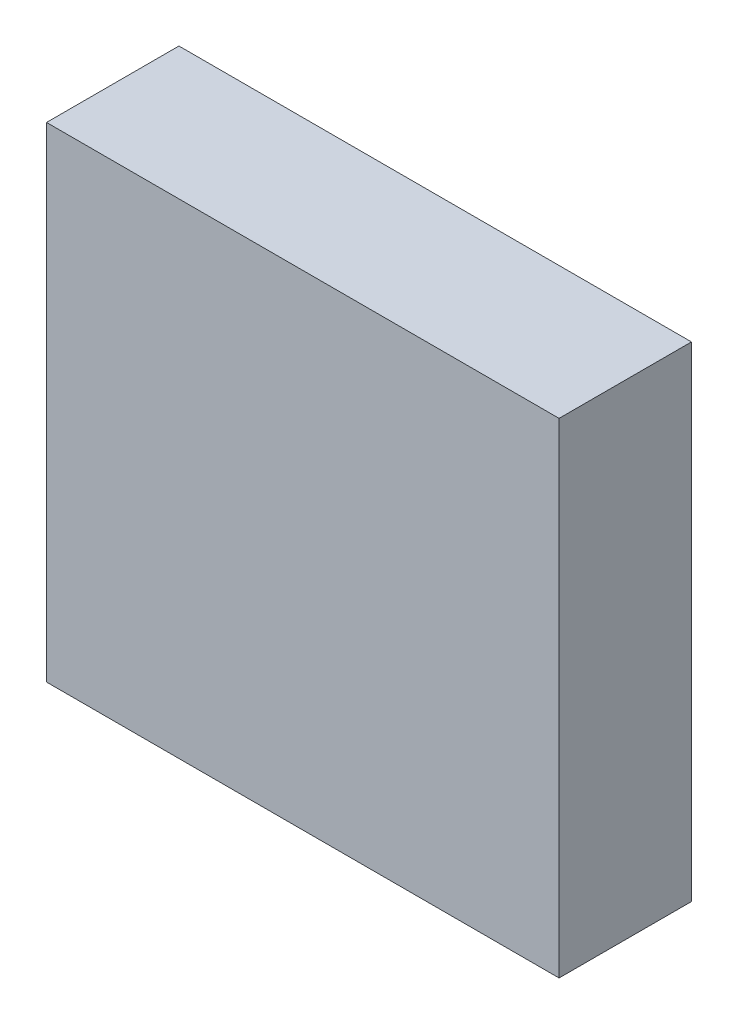
ISO-10303-21;
HEADER;
FILE_DESCRIPTION(('STEP AP214'),'2;1');
FILE_NAME('part.step','',(''),(''),'','','');
FILE_SCHEMA(('AUTOMOTIVE_DESIGN { 1 0 10303 214 1 1 1 1 }'));
ENDSEC;
DATA;
#1=APPLICATION_CONTEXT('core data for automotive mechanical design processes');
#2=APPLICATION_PROTOCOL_DEFINITION('international standard','automotive_design',2000,#1);
#3=PRODUCT_CONTEXT('',#1,'mechanical');
#4=PRODUCT('Part','Part','',(#3));
#5=PRODUCT_RELATED_PRODUCT_CATEGORY('part','',(#4));
#6=PRODUCT_DEFINITION_FORMATION('','',#4);
#7=PRODUCT_DEFINITION_CONTEXT('part definition',#1,'design');
#8=PRODUCT_DEFINITION('design','',#6,#7);
#9=PRODUCT_DEFINITION_SHAPE('','',#8);
#10=(LENGTH_UNIT() NAMED_UNIT(*) SI_UNIT(.MILLI.,.METRE.));
#11=(NAMED_UNIT(*) PLANE_ANGLE_UNIT() SI_UNIT($,.RADIAN.));
#12=(NAMED_UNIT(*) SI_UNIT($,.STERADIAN.) SOLID_ANGLE_UNIT());
#13=UNCERTAINTY_MEASURE_WITH_UNIT(LENGTH_MEASURE(1.E-05),#10,'distance_accuracy_value','');
#14=(GEOMETRIC_REPRESENTATION_CONTEXT(3) GLOBAL_UNCERTAINTY_ASSIGNED_CONTEXT((#13)) GLOBAL_UNIT_ASSIGNED_CONTEXT((#10,
#11,#12)) REPRESENTATION_CONTEXT('',''));
#15=CARTESIAN_POINT('',(0.,0.,0.));
#16=DIRECTION('',(0.,0.,1.));
#17=DIRECTION('',(1.,0.,0.));
#18=AXIS2_PLACEMENT_3D('',#15,#16,#17);
#19=CARTESIAN_POINT('',(-67.3279106981689,26.7207645583358,10.));
#20=DIRECTION('',(1.,0.,0.));
#21=DIRECTION('',(0.,0.,-1.));
#22=AXIS2_PLACEMENT_3D('',#19,#20,#21);
#23=PLANE('',#22);
#24=DIRECTION('',(0.,-1.,0.));
#25=VECTOR('',#24,1.);
#26=CARTESIAN_POINT('',(-67.3279106981689,26.7207645583358,0.));
#27=LINE('',#26,#25);
#28=CARTESIAN_POINT('',(-67.3279106981689,26.7207645583358,0.));
#29=VERTEX_POINT('',#28);
#30=CARTESIAN_POINT('',(-67.3279106981689,-9.88878688379356,0.));
#31=VERTEX_POINT('',#30);
#32=EDGE_CURVE('E102',#29,#31,#27,.T.);
#33=ORIENTED_EDGE('',*,*,#32,.T.);
#34=DIRECTION('',(0.,0.,-1.));
#35=VECTOR('',#34,1.);
#36=CARTESIAN_POINT('',(-67.3279106981689,-9.88878688379356,10.));
#37=LINE('',#36,#35);
#38=CARTESIAN_POINT('',(-67.3279106981689,-9.88878688379356,10.));
#39=VERTEX_POINT('',#38);
#40=EDGE_CURVE('E11',#39,#31,#37,.T.);
#41=ORIENTED_EDGE('',*,*,#40,.F.);
#42=DIRECTION('',(0.,-1.,0.));
#43=VECTOR('',#42,1.);
#44=CARTESIAN_POINT('',(-67.3279106981689,26.7207645583358,10.));
#45=LINE('',#44,#43);
#46=CARTESIAN_POINT('',(-67.3279106981689,26.7207645583358,10.));
#47=VERTEX_POINT('',#46);
#48=EDGE_CURVE('E90',#47,#39,#45,.T.);
#49=ORIENTED_EDGE('',*,*,#48,.F.);
#50=DIRECTION('',(0.,0.,-1.));
#51=VECTOR('',#50,1.);
#52=CARTESIAN_POINT('',(-67.3279106981689,26.7207645583358,10.));
#53=LINE('',#52,#51);
#54=EDGE_CURVE('E98',#47,#29,#53,.T.);
#55=ORIENTED_EDGE('',*,*,#54,.T.);
#56=EDGE_LOOP('',(#33,#41,#49,#55));
#57=FACE_BOUND('',#56,.T.);
#58=ADVANCED_FACE('F39',(#57),#23,.F.);
#59=CARTESIAN_POINT('',(-67.3279106981689,-9.88878688379356,10.));
#60=DIRECTION('',(0.,1.,0.));
#61=DIRECTION('',(0.,0.,1.));
#62=AXIS2_PLACEMENT_3D('',#59,#60,#61);
#63=PLANE('',#62);
#64=DIRECTION('',(1.,0.,0.));
#65=VECTOR('',#64,1.);
#66=CARTESIAN_POINT('',(-67.3279106981689,-9.88878688379356,0.));
#67=LINE('',#66,#65);
#68=CARTESIAN_POINT('',(-28.6143620467218,-9.88878688379356,0.));
#69=VERTEX_POINT('',#68);
#70=EDGE_CURVE('E94',#31,#69,#67,.T.);
#71=ORIENTED_EDGE('',*,*,#70,.T.);
#72=DIRECTION('',(0.,0.,-1.));
#73=VECTOR('',#72,1.);
#74=CARTESIAN_POINT('',(-28.6143620467218,-9.88878688379356,10.));
#75=LINE('',#74,#73);
#76=CARTESIAN_POINT('',(-28.6143620467218,-9.88878688379356,10.));
#77=VERTEX_POINT('',#76);
#78=EDGE_CURVE('E47',#77,#69,#75,.T.);
#79=ORIENTED_EDGE('',*,*,#78,.F.);
#80=DIRECTION('',(1.,0.,0.));
#81=VECTOR('',#80,1.);
#82=CARTESIAN_POINT('',(-67.3279106981689,-9.88878688379356,10.));
#83=LINE('',#82,#81);
#84=EDGE_CURVE('E85',#39,#77,#83,.T.);
#85=ORIENTED_EDGE('',*,*,#84,.F.);
#86=ORIENTED_EDGE('',*,*,#40,.T.);
#87=EDGE_LOOP('',(#71,#79,#85,#86));
#88=FACE_BOUND('',#87,.T.);
#89=ADVANCED_FACE('F93',(#88),#63,.F.);
#90=CARTESIAN_POINT('',(-28.6143620467218,26.7207645583358,10.));
#91=DIRECTION('',(-1.,0.,0.));
#92=DIRECTION('',(0.,0.,1.));
#93=AXIS2_PLACEMENT_3D('',#90,#91,#92);
#94=PLANE('',#93);
#95=DIRECTION('',(0.,1.,0.));
#96=VECTOR('',#95,1.);
#97=CARTESIAN_POINT('',(-28.6143620467218,26.7207645583358,0.));
#98=LINE('',#97,#96);
#99=CARTESIAN_POINT('',(-28.6143620467218,26.7207645583358,0.));
#100=VERTEX_POINT('',#99);
#101=EDGE_CURVE('E72',#69,#100,#98,.T.);
#102=ORIENTED_EDGE('',*,*,#101,.T.);
#103=DIRECTION('',(0.,0.,-1.));
#104=VECTOR('',#103,1.);
#105=CARTESIAN_POINT('',(-28.6143620467218,26.7207645583358,10.));
#106=LINE('',#105,#104);
#107=CARTESIAN_POINT('',(-28.6143620467218,26.7207645583358,10.));
#108=VERTEX_POINT('',#107);
#109=EDGE_CURVE('E95',#108,#100,#106,.T.);
#110=ORIENTED_EDGE('',*,*,#109,.F.);
#111=DIRECTION('',(0.,1.,0.));
#112=VECTOR('',#111,1.);
#113=CARTESIAN_POINT('',(-28.6143620467218,26.7207645583358,10.));
#114=LINE('',#113,#112);
#115=EDGE_CURVE('E88',#77,#108,#114,.T.);
#116=ORIENTED_EDGE('',*,*,#115,.F.);
#117=ORIENTED_EDGE('',*,*,#78,.T.);
#118=EDGE_LOOP('',(#102,#110,#116,#117));
#119=FACE_BOUND('',#118,.T.);
#120=ADVANCED_FACE('F96',(#119),#94,.F.);
#121=CARTESIAN_POINT('',(-67.3279106981689,26.7207645583358,10.));
#122=DIRECTION('',(0.,-1.,0.));
#123=DIRECTION('',(0.,0.,-1.));
#124=AXIS2_PLACEMENT_3D('',#121,#122,#123);
#125=PLANE('',#124);
#126=DIRECTION('',(-1.,0.,0.));
#127=VECTOR('',#126,1.);
#128=CARTESIAN_POINT('',(-67.3279106981689,26.7207645583358,0.));
#129=LINE('',#128,#127);
#130=EDGE_CURVE('E78',#100,#29,#129,.T.);
#131=ORIENTED_EDGE('',*,*,#130,.T.);
#132=ORIENTED_EDGE('',*,*,#54,.F.);
#133=DIRECTION('',(-1.,0.,0.));
#134=VECTOR('',#133,1.);
#135=CARTESIAN_POINT('',(-67.3279106981689,26.7207645583358,10.));
#136=LINE('',#135,#134);
#137=EDGE_CURVE('E55',#108,#47,#136,.T.);
#138=ORIENTED_EDGE('',*,*,#137,.F.);
#139=ORIENTED_EDGE('',*,*,#109,.T.);
#140=EDGE_LOOP('',(#131,#132,#138,#139));
#141=FACE_BOUND('',#140,.T.);
#142=ADVANCED_FACE('F109',(#141),#125,.F.);
#143=CARTESIAN_POINT('',(0.,0.,10.));
#144=DIRECTION('',(0.,0.,1.));
#145=DIRECTION('',(1.,0.,0.));
#146=AXIS2_PLACEMENT_3D('',#143,#144,#145);
#147=PLANE('',#146);
#148=ORIENTED_EDGE('',*,*,#48,.T.);
#149=ORIENTED_EDGE('',*,*,#84,.T.);
#150=ORIENTED_EDGE('',*,*,#115,.T.);
#151=ORIENTED_EDGE('',*,*,#137,.T.);
#152=EDGE_LOOP('',(#148,#149,#150,#151));
#153=FACE_BOUND('',#152,.T.);
#154=ADVANCED_FACE('F86',(#153),#147,.T.);
#155=CARTESIAN_POINT('',(0.,0.,0.));
#156=DIRECTION('',(0.,0.,1.));
#157=DIRECTION('',(1.,0.,0.));
#158=AXIS2_PLACEMENT_3D('',#155,#156,#157);
#159=PLANE('',#158);
#160=ORIENTED_EDGE('',*,*,#32,.F.);
#161=ORIENTED_EDGE('',*,*,#130,.F.);
#162=ORIENTED_EDGE('',*,*,#101,.F.);
#163=ORIENTED_EDGE('',*,*,#70,.F.);
#164=EDGE_LOOP('',(#160,#161,#162,#163));
#165=FACE_BOUND('',#164,.T.);
#166=ADVANCED_FACE('F112',(#165),#159,.F.);
#167=CLOSED_SHELL('',(#58,#89,#120,#142,#154,#166));
#168=MANIFOLD_SOLID_BREP('B2',#167);
#169=ADVANCED_BREP_SHAPE_REPRESENTATION('',(#18,#168),#14);
#170=SHAPE_DEFINITION_REPRESENTATION(#9,#169);
ENDSEC;
END-ISO-10303-21;
